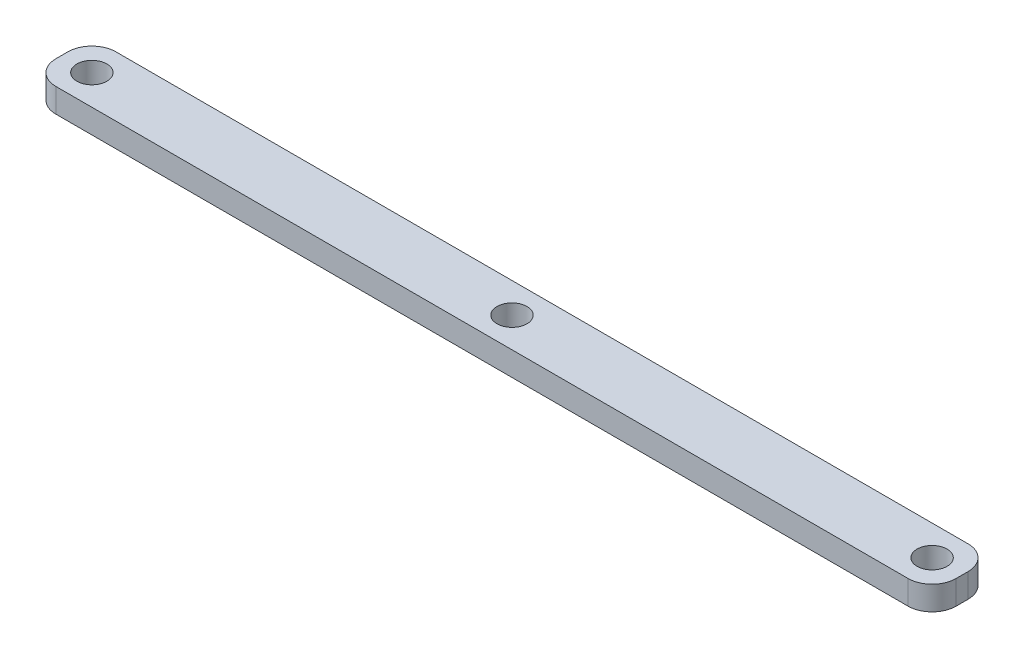
ISO-10303-21;
HEADER;
FILE_DESCRIPTION(('STEP AP214'),'2;1');
FILE_NAME('part.step','',(''),(''),'','','');
FILE_SCHEMA(('AUTOMOTIVE_DESIGN { 1 0 10303 214 1 1 1 1 }'));
ENDSEC;
DATA;
#1=APPLICATION_CONTEXT('core data for automotive mechanical design processes');
#2=APPLICATION_PROTOCOL_DEFINITION('international standard','automotive_design',2000,#1);
#3=PRODUCT_CONTEXT('',#1,'mechanical');
#4=PRODUCT('Part','Part','',(#3));
#5=PRODUCT_RELATED_PRODUCT_CATEGORY('part','',(#4));
#6=PRODUCT_DEFINITION_FORMATION('','',#4);
#7=PRODUCT_DEFINITION_CONTEXT('part definition',#1,'design');
#8=PRODUCT_DEFINITION('design','',#6,#7);
#9=PRODUCT_DEFINITION_SHAPE('','',#8);
#10=(LENGTH_UNIT() NAMED_UNIT(*) SI_UNIT(.MILLI.,.METRE.));
#11=(NAMED_UNIT(*) PLANE_ANGLE_UNIT() SI_UNIT($,.RADIAN.));
#12=(NAMED_UNIT(*) SI_UNIT($,.STERADIAN.) SOLID_ANGLE_UNIT());
#13=UNCERTAINTY_MEASURE_WITH_UNIT(LENGTH_MEASURE(1.E-05),#10,'distance_accuracy_value','');
#14=(GEOMETRIC_REPRESENTATION_CONTEXT(3) GLOBAL_UNCERTAINTY_ASSIGNED_CONTEXT((#13)) GLOBAL_UNIT_ASSIGNED_CONTEXT((#10,
#11,#12)) REPRESENTATION_CONTEXT('',''));
#15=CARTESIAN_POINT('',(0.,0.,0.));
#16=DIRECTION('',(0.,0.,1.));
#17=DIRECTION('',(1.,0.,0.));
#18=AXIS2_PLACEMENT_3D('',#15,#16,#17);
#19=CARTESIAN_POINT('',(0.,4.,0.));
#20=DIRECTION('',(0.,-1.,0.));
#21=DIRECTION('',(0.,0.,-1.));
#22=AXIS2_PLACEMENT_3D('',#19,#20,#21);
#23=PLANE('',#22);
#24=DIRECTION('',(1.,0.,0.));
#25=VECTOR('',#24,1.);
#26=CARTESIAN_POINT('',(-75.,4.,5.00000000000002));
#27=LINE('',#26,#25);
#28=CARTESIAN_POINT('',(-71.,4.,5.00000000000002));
#29=VERTEX_POINT('',#28);
#30=CARTESIAN_POINT('',(71.,4.,5.));
#31=VERTEX_POINT('',#30);
#32=EDGE_CURVE('E137',#29,#31,#27,.T.);
#33=ORIENTED_EDGE('',*,*,#32,.T.);
#34=CARTESIAN_POINT('',(71.,4.,0.999999999999998));
#35=DIRECTION('',(0.,-1.,0.));
#36=DIRECTION('',(0.,0.,-1.));
#37=AXIS2_PLACEMENT_3D('',#34,#35,#36);
#38=CIRCLE('',#37,4.);
#39=CARTESIAN_POINT('',(75.,4.,0.999999999999998));
#40=VERTEX_POINT('',#39);
#41=EDGE_CURVE('E156',#31,#40,#38,.F.);
#42=ORIENTED_EDGE('',*,*,#41,.T.);
#43=DIRECTION('',(0.,0.,-1.));
#44=VECTOR('',#43,1.);
#45=CARTESIAN_POINT('',(75.,4.,5.));
#46=LINE('',#45,#44);
#47=CARTESIAN_POINT('',(75.,4.,-1.00000000000001));
#48=VERTEX_POINT('',#47);
#49=EDGE_CURVE('E120',#40,#48,#46,.T.);
#50=ORIENTED_EDGE('',*,*,#49,.T.);
#51=CARTESIAN_POINT('',(71.,4.,-1.00000000000001));
#52=DIRECTION('',(0.,-1.,0.));
#53=DIRECTION('',(0.,0.,-1.));
#54=AXIS2_PLACEMENT_3D('',#51,#52,#53);
#55=CIRCLE('',#54,4.);
#56=CARTESIAN_POINT('',(71.,4.,-5.00000000000002));
#57=VERTEX_POINT('',#56);
#58=EDGE_CURVE('E154',#48,#57,#55,.F.);
#59=ORIENTED_EDGE('',*,*,#58,.T.);
#60=DIRECTION('',(-1.,0.,0.));
#61=VECTOR('',#60,1.);
#62=CARTESIAN_POINT('',(-75.,4.,-4.99999999999998));
#63=LINE('',#62,#61);
#64=CARTESIAN_POINT('',(-71.,4.,-4.99999999999999));
#65=VERTEX_POINT('',#64);
#66=EDGE_CURVE('E167',#57,#65,#63,.T.);
#67=ORIENTED_EDGE('',*,*,#66,.T.);
#68=CARTESIAN_POINT('',(-71.,4.,-0.999999999999985));
#69=DIRECTION('',(0.,-1.,0.));
#70=DIRECTION('',(0.,0.,-1.));
#71=AXIS2_PLACEMENT_3D('',#68,#69,#70);
#72=CIRCLE('',#71,4.);
#73=CARTESIAN_POINT('',(-75.,4.,-0.999999999999985));
#74=VERTEX_POINT('',#73);
#75=EDGE_CURVE('E55',#65,#74,#72,.F.);
#76=ORIENTED_EDGE('',*,*,#75,.T.);
#77=DIRECTION('',(0.,0.,1.));
#78=VECTOR('',#77,1.);
#79=CARTESIAN_POINT('',(-75.,4.,5.00000000000002));
#80=LINE('',#79,#78);
#81=CARTESIAN_POINT('',(-75.,4.,1.00000000000002));
#82=VERTEX_POINT('',#81);
#83=EDGE_CURVE('E175',#74,#82,#80,.T.);
#84=ORIENTED_EDGE('',*,*,#83,.T.);
#85=CARTESIAN_POINT('',(-71.,4.,1.00000000000002));
#86=DIRECTION('',(0.,-1.,0.));
#87=DIRECTION('',(0.,0.,-1.));
#88=AXIS2_PLACEMENT_3D('',#85,#86,#87);
#89=CIRCLE('',#88,4.);
#90=EDGE_CURVE('E151',#82,#29,#89,.F.);
#91=ORIENTED_EDGE('',*,*,#90,.T.);
#92=EDGE_LOOP('',(#33,#42,#50,#59,#67,#76,#84,#91));
#93=FACE_BOUND('',#92,.T.);
#94=CARTESIAN_POINT('',(-70.,4.,0.));
#95=DIRECTION('',(0.,1.,0.));
#96=DIRECTION('',(0.,0.,1.));
#97=AXIS2_PLACEMENT_3D('',#94,#95,#96);
#98=CIRCLE('',#97,2.50000000000001);
#99=CARTESIAN_POINT('',(-70.,4.,2.50000000000002));
#100=VERTEX_POINT('',#99);
#101=EDGE_CURVE('E128',#100,#100,#98,.T.);
#102=ORIENTED_EDGE('',*,*,#101,.F.);
#103=EDGE_LOOP('',(#102));
#104=FACE_BOUND('',#103,.T.);
#105=CARTESIAN_POINT('',(70.,4.,0.));
#106=DIRECTION('',(0.,1.,0.));
#107=DIRECTION('',(0.,0.,-1.));
#108=AXIS2_PLACEMENT_3D('',#105,#106,#107);
#109=CIRCLE('',#108,2.50000000000001);
#110=CARTESIAN_POINT('',(70.,4.,-2.50000000000001));
#111=VERTEX_POINT('',#110);
#112=EDGE_CURVE('E182',#111,#111,#109,.T.);
#113=ORIENTED_EDGE('',*,*,#112,.F.);
#114=EDGE_LOOP('',(#113));
#115=FACE_BOUND('',#114,.T.);
#116=CARTESIAN_POINT('',(0.,4.,0.));
#117=DIRECTION('',(0.,1.,0.));
#118=DIRECTION('',(0.,0.,1.));
#119=AXIS2_PLACEMENT_3D('',#116,#117,#118);
#120=CIRCLE('',#119,2.5);
#121=CARTESIAN_POINT('',(0.,4.,2.5));
#122=VERTEX_POINT('',#121);
#123=EDGE_CURVE('E187',#122,#122,#120,.T.);
#124=ORIENTED_EDGE('',*,*,#123,.F.);
#125=EDGE_LOOP('',(#124));
#126=FACE_BOUND('',#125,.T.);
#127=ADVANCED_FACE('F34',(#93,#104,#115,#126),#23,.F.);
#128=CARTESIAN_POINT('',(0.,0.,0.));
#129=DIRECTION('',(0.,-1.,0.));
#130=DIRECTION('',(0.,0.,-1.));
#131=AXIS2_PLACEMENT_3D('',#128,#129,#130);
#132=PLANE('',#131);
#133=CARTESIAN_POINT('',(70.,0.,0.));
#134=DIRECTION('',(0.,1.,0.));
#135=DIRECTION('',(0.,0.,-1.));
#136=AXIS2_PLACEMENT_3D('',#133,#134,#135);
#137=CIRCLE('',#136,2.50000000000001);
#138=CARTESIAN_POINT('',(70.,0.,-2.50000000000001));
#139=VERTEX_POINT('',#138);
#140=EDGE_CURVE('E184',#139,#139,#137,.T.);
#141=ORIENTED_EDGE('',*,*,#140,.T.);
#142=EDGE_LOOP('',(#141));
#143=FACE_BOUND('',#142,.T.);
#144=DIRECTION('',(0.,0.,-1.));
#145=VECTOR('',#144,1.);
#146=CARTESIAN_POINT('',(75.,0.,5.));
#147=LINE('',#146,#145);
#148=CARTESIAN_POINT('',(75.,0.,0.999999999999998));
#149=VERTEX_POINT('',#148);
#150=CARTESIAN_POINT('',(75.,0.,-1.00000000000001));
#151=VERTEX_POINT('',#150);
#152=EDGE_CURVE('E117',#149,#151,#147,.T.);
#153=ORIENTED_EDGE('',*,*,#152,.F.);
#154=CARTESIAN_POINT('',(71.,0.,0.999999999999998));
#155=DIRECTION('',(0.,-1.,0.));
#156=DIRECTION('',(0.,0.,-1.));
#157=AXIS2_PLACEMENT_3D('',#154,#155,#156);
#158=CIRCLE('',#157,4.);
#159=CARTESIAN_POINT('',(71.,0.,5.));
#160=VERTEX_POINT('',#159);
#161=EDGE_CURVE('E100',#149,#160,#158,.T.);
#162=ORIENTED_EDGE('',*,*,#161,.T.);
#163=DIRECTION('',(1.,0.,0.));
#164=VECTOR('',#163,1.);
#165=CARTESIAN_POINT('',(-75.,0.,5.00000000000002));
#166=LINE('',#165,#164);
#167=CARTESIAN_POINT('',(-71.,0.,5.00000000000002));
#168=VERTEX_POINT('',#167);
#169=EDGE_CURVE('E141',#168,#160,#166,.T.);
#170=ORIENTED_EDGE('',*,*,#169,.F.);
#171=CARTESIAN_POINT('',(-71.,0.,1.00000000000002));
#172=DIRECTION('',(0.,-1.,0.));
#173=DIRECTION('',(0.,0.,-1.));
#174=AXIS2_PLACEMENT_3D('',#171,#172,#173);
#175=CIRCLE('',#174,4.);
#176=CARTESIAN_POINT('',(-75.,0.,1.00000000000002));
#177=VERTEX_POINT('',#176);
#178=EDGE_CURVE('E121',#168,#177,#175,.T.);
#179=ORIENTED_EDGE('',*,*,#178,.T.);
#180=DIRECTION('',(0.,0.,1.));
#181=VECTOR('',#180,1.);
#182=CARTESIAN_POINT('',(-75.,0.,5.00000000000002));
#183=LINE('',#182,#181);
#184=CARTESIAN_POINT('',(-75.,0.,-0.999999999999985));
#185=VERTEX_POINT('',#184);
#186=EDGE_CURVE('E131',#185,#177,#183,.T.);
#187=ORIENTED_EDGE('',*,*,#186,.F.);
#188=CARTESIAN_POINT('',(-71.,0.,-0.999999999999985));
#189=DIRECTION('',(0.,-1.,0.));
#190=DIRECTION('',(0.,0.,-1.));
#191=AXIS2_PLACEMENT_3D('',#188,#189,#190);
#192=CIRCLE('',#191,4.);
#193=CARTESIAN_POINT('',(-71.,0.,-4.99999999999999));
#194=VERTEX_POINT('',#193);
#195=EDGE_CURVE('E145',#185,#194,#192,.T.);
#196=ORIENTED_EDGE('',*,*,#195,.T.);
#197=DIRECTION('',(-1.,0.,0.));
#198=VECTOR('',#197,1.);
#199=CARTESIAN_POINT('',(-75.,0.,-4.99999999999998));
#200=LINE('',#199,#198);
#201=CARTESIAN_POINT('',(71.,0.,-5.00000000000002));
#202=VERTEX_POINT('',#201);
#203=EDGE_CURVE('E127',#202,#194,#200,.T.);
#204=ORIENTED_EDGE('',*,*,#203,.F.);
#205=CARTESIAN_POINT('',(71.,0.,-1.00000000000001));
#206=DIRECTION('',(0.,-1.,0.));
#207=DIRECTION('',(0.,0.,-1.));
#208=AXIS2_PLACEMENT_3D('',#205,#206,#207);
#209=CIRCLE('',#208,4.);
#210=EDGE_CURVE('E111',#202,#151,#209,.T.);
#211=ORIENTED_EDGE('',*,*,#210,.T.);
#212=EDGE_LOOP('',(#153,#162,#170,#179,#187,#196,#204,#211));
#213=FACE_BOUND('',#212,.T.);
#214=CARTESIAN_POINT('',(-70.,0.,0.));
#215=DIRECTION('',(0.,1.,0.));
#216=DIRECTION('',(0.,0.,1.));
#217=AXIS2_PLACEMENT_3D('',#214,#215,#216);
#218=CIRCLE('',#217,2.50000000000001);
#219=CARTESIAN_POINT('',(-70.,0.,2.50000000000002));
#220=VERTEX_POINT('',#219);
#221=EDGE_CURVE('E134',#220,#220,#218,.T.);
#222=ORIENTED_EDGE('',*,*,#221,.T.);
#223=EDGE_LOOP('',(#222));
#224=FACE_BOUND('',#223,.T.);
#225=CARTESIAN_POINT('',(0.,0.,0.));
#226=DIRECTION('',(0.,1.,0.));
#227=DIRECTION('',(0.,0.,1.));
#228=AXIS2_PLACEMENT_3D('',#225,#226,#227);
#229=CIRCLE('',#228,2.5);
#230=CARTESIAN_POINT('',(0.,0.,2.5));
#231=VERTEX_POINT('',#230);
#232=EDGE_CURVE('E190',#231,#231,#229,.T.);
#233=ORIENTED_EDGE('',*,*,#232,.T.);
#234=EDGE_LOOP('',(#233));
#235=FACE_BOUND('',#234,.T.);
#236=ADVANCED_FACE('F124',(#143,#213,#224,#235),#132,.T.);
#237=CARTESIAN_POINT('',(75.,4.,5.));
#238=DIRECTION('',(-1.,0.,0.));
#239=DIRECTION('',(0.,0.,1.));
#240=AXIS2_PLACEMENT_3D('',#237,#238,#239);
#241=PLANE('',#240);
#242=ORIENTED_EDGE('',*,*,#49,.F.);
#243=DIRECTION('',(0.,-1.,0.));
#244=VECTOR('',#243,1.);
#245=CARTESIAN_POINT('',(75.,4.,0.999999999999998));
#246=LINE('',#245,#244);
#247=EDGE_CURVE('E104',#40,#149,#246,.T.);
#248=ORIENTED_EDGE('',*,*,#247,.T.);
#249=ORIENTED_EDGE('',*,*,#152,.T.);
#250=DIRECTION('',(0.,-1.,0.));
#251=VECTOR('',#250,1.);
#252=CARTESIAN_POINT('',(75.,4.,-1.00000000000001));
#253=LINE('',#252,#251);
#254=EDGE_CURVE('E122',#151,#48,#253,.F.);
#255=ORIENTED_EDGE('',*,*,#254,.T.);
#256=EDGE_LOOP('',(#242,#248,#249,#255));
#257=FACE_BOUND('',#256,.T.);
#258=ADVANCED_FACE('F116',(#257),#241,.F.);
#259=CARTESIAN_POINT('',(-75.,4.,-4.99999999999998));
#260=DIRECTION('',(0.,0.,1.));
#261=DIRECTION('',(1.,0.,0.));
#262=AXIS2_PLACEMENT_3D('',#259,#260,#261);
#263=PLANE('',#262);
#264=ORIENTED_EDGE('',*,*,#66,.F.);
#265=DIRECTION('',(0.,-1.,0.));
#266=VECTOR('',#265,1.);
#267=CARTESIAN_POINT('',(71.,4.,-5.00000000000002));
#268=LINE('',#267,#266);
#269=EDGE_CURVE('E160',#57,#202,#268,.T.);
#270=ORIENTED_EDGE('',*,*,#269,.T.);
#271=ORIENTED_EDGE('',*,*,#203,.T.);
#272=DIRECTION('',(0.,-1.,0.));
#273=VECTOR('',#272,1.);
#274=CARTESIAN_POINT('',(-71.,4.,-4.99999999999999));
#275=LINE('',#274,#273);
#276=EDGE_CURVE('E158',#194,#65,#275,.F.);
#277=ORIENTED_EDGE('',*,*,#276,.T.);
#278=EDGE_LOOP('',(#264,#270,#271,#277));
#279=FACE_BOUND('',#278,.T.);
#280=ADVANCED_FACE('F165',(#279),#263,.F.);
#281=CARTESIAN_POINT('',(-75.,4.,5.00000000000002));
#282=DIRECTION('',(1.,0.,0.));
#283=DIRECTION('',(0.,0.,-1.));
#284=AXIS2_PLACEMENT_3D('',#281,#282,#283);
#285=PLANE('',#284);
#286=ORIENTED_EDGE('',*,*,#83,.F.);
#287=DIRECTION('',(0.,-1.,0.));
#288=VECTOR('',#287,1.);
#289=CARTESIAN_POINT('',(-75.,4.,-0.999999999999985));
#290=LINE('',#289,#288);
#291=EDGE_CURVE('E11',#74,#185,#290,.T.);
#292=ORIENTED_EDGE('',*,*,#291,.T.);
#293=ORIENTED_EDGE('',*,*,#186,.T.);
#294=DIRECTION('',(0.,-1.,0.));
#295=VECTOR('',#294,1.);
#296=CARTESIAN_POINT('',(-75.,4.,1.00000000000002));
#297=LINE('',#296,#295);
#298=EDGE_CURVE('E42',#177,#82,#297,.F.);
#299=ORIENTED_EDGE('',*,*,#298,.T.);
#300=EDGE_LOOP('',(#286,#292,#293,#299));
#301=FACE_BOUND('',#300,.T.);
#302=ADVANCED_FACE('F174',(#301),#285,.F.);
#303=CARTESIAN_POINT('',(-75.,4.,5.00000000000002));
#304=DIRECTION('',(0.,0.,-1.));
#305=DIRECTION('',(-1.,0.,0.));
#306=AXIS2_PLACEMENT_3D('',#303,#304,#305);
#307=PLANE('',#306);
#308=ORIENTED_EDGE('',*,*,#169,.T.);
#309=DIRECTION('',(0.,-1.,0.));
#310=VECTOR('',#309,1.);
#311=CARTESIAN_POINT('',(71.,4.,5.));
#312=LINE('',#311,#310);
#313=EDGE_CURVE('E105',#160,#31,#312,.F.);
#314=ORIENTED_EDGE('',*,*,#313,.T.);
#315=ORIENTED_EDGE('',*,*,#32,.F.);
#316=DIRECTION('',(0.,-1.,0.));
#317=VECTOR('',#316,1.);
#318=CARTESIAN_POINT('',(-71.,4.,5.00000000000002));
#319=LINE('',#318,#317);
#320=EDGE_CURVE('E110',#29,#168,#319,.T.);
#321=ORIENTED_EDGE('',*,*,#320,.T.);
#322=EDGE_LOOP('',(#308,#314,#315,#321));
#323=FACE_BOUND('',#322,.T.);
#324=ADVANCED_FACE('F211',(#323),#307,.F.);
#325=CARTESIAN_POINT('',(-70.,4.,0.));
#326=DIRECTION('',(0.,-1.,0.));
#327=DIRECTION('',(0.,0.,-1.));
#328=AXIS2_PLACEMENT_3D('',#325,#326,#327);
#329=CYLINDRICAL_SURFACE('',#328,2.50000000000001);
#330=ORIENTED_EDGE('',*,*,#101,.T.);
#331=EDGE_LOOP('',(#330));
#332=FACE_BOUND('',#331,.T.);
#333=ORIENTED_EDGE('',*,*,#221,.F.);
#334=EDGE_LOOP('',(#333));
#335=FACE_BOUND('',#334,.T.);
#336=ADVANCED_FACE('F208',(#332,#335),#329,.F.);
#337=CARTESIAN_POINT('',(70.,4.,0.));
#338=DIRECTION('',(0.,-1.,0.));
#339=DIRECTION('',(0.,0.,-1.));
#340=AXIS2_PLACEMENT_3D('',#337,#338,#339);
#341=CYLINDRICAL_SURFACE('',#340,2.50000000000001);
#342=ORIENTED_EDGE('',*,*,#112,.T.);
#343=EDGE_LOOP('',(#342));
#344=FACE_BOUND('',#343,.T.);
#345=ORIENTED_EDGE('',*,*,#140,.F.);
#346=EDGE_LOOP('',(#345));
#347=FACE_BOUND('',#346,.T.);
#348=ADVANCED_FACE('F295',(#344,#347),#341,.F.);
#349=CARTESIAN_POINT('',(0.,4.,0.));
#350=DIRECTION('',(0.,-1.,0.));
#351=DIRECTION('',(0.,0.,-1.));
#352=AXIS2_PLACEMENT_3D('',#349,#350,#351);
#353=CYLINDRICAL_SURFACE('',#352,2.5);
#354=ORIENTED_EDGE('',*,*,#123,.T.);
#355=EDGE_LOOP('',(#354));
#356=FACE_BOUND('',#355,.T.);
#357=ORIENTED_EDGE('',*,*,#232,.F.);
#358=EDGE_LOOP('',(#357));
#359=FACE_BOUND('',#358,.T.);
#360=ADVANCED_FACE('F196',(#356,#359),#353,.F.);
#361=CARTESIAN_POINT('',(71.,4.,0.999999999999998));
#362=DIRECTION('',(0.,-1.,0.));
#363=DIRECTION('',(0.,0.,-1.));
#364=AXIS2_PLACEMENT_3D('',#361,#362,#363);
#365=CYLINDRICAL_SURFACE('',#364,4.);
#366=ORIENTED_EDGE('',*,*,#41,.F.);
#367=ORIENTED_EDGE('',*,*,#313,.F.);
#368=ORIENTED_EDGE('',*,*,#161,.F.);
#369=ORIENTED_EDGE('',*,*,#247,.F.);
#370=EDGE_LOOP('',(#366,#367,#368,#369));
#371=FACE_BOUND('',#370,.T.);
#372=ADVANCED_FACE('F103',(#371),#365,.T.);
#373=CARTESIAN_POINT('',(71.,4.,-1.00000000000001));
#374=DIRECTION('',(0.,-1.,0.));
#375=DIRECTION('',(0.,0.,-1.));
#376=AXIS2_PLACEMENT_3D('',#373,#374,#375);
#377=CYLINDRICAL_SURFACE('',#376,4.);
#378=ORIENTED_EDGE('',*,*,#58,.F.);
#379=ORIENTED_EDGE('',*,*,#254,.F.);
#380=ORIENTED_EDGE('',*,*,#210,.F.);
#381=ORIENTED_EDGE('',*,*,#269,.F.);
#382=EDGE_LOOP('',(#378,#379,#380,#381));
#383=FACE_BOUND('',#382,.T.);
#384=ADVANCED_FACE('F223',(#383),#377,.T.);
#385=CARTESIAN_POINT('',(-71.,4.,-0.999999999999985));
#386=DIRECTION('',(0.,-1.,0.));
#387=DIRECTION('',(0.,0.,-1.));
#388=AXIS2_PLACEMENT_3D('',#385,#386,#387);
#389=CYLINDRICAL_SURFACE('',#388,4.);
#390=ORIENTED_EDGE('',*,*,#75,.F.);
#391=ORIENTED_EDGE('',*,*,#276,.F.);
#392=ORIENTED_EDGE('',*,*,#195,.F.);
#393=ORIENTED_EDGE('',*,*,#291,.F.);
#394=EDGE_LOOP('',(#390,#391,#392,#393));
#395=FACE_BOUND('',#394,.T.);
#396=ADVANCED_FACE('F173',(#395),#389,.T.);
#397=CARTESIAN_POINT('',(-71.,4.,1.00000000000002));
#398=DIRECTION('',(0.,-1.,0.));
#399=DIRECTION('',(0.,0.,-1.));
#400=AXIS2_PLACEMENT_3D('',#397,#398,#399);
#401=CYLINDRICAL_SURFACE('',#400,4.);
#402=ORIENTED_EDGE('',*,*,#90,.F.);
#403=ORIENTED_EDGE('',*,*,#298,.F.);
#404=ORIENTED_EDGE('',*,*,#178,.F.);
#405=ORIENTED_EDGE('',*,*,#320,.F.);
#406=EDGE_LOOP('',(#402,#403,#404,#405));
#407=FACE_BOUND('',#406,.T.);
#408=ADVANCED_FACE('F36',(#407),#401,.T.);
#409=CLOSED_SHELL('',(#127,#236,#258,#280,#302,#324,#336,#348,#360,#372,#384,#396,#408));
#410=MANIFOLD_SOLID_BREP('B2',#409);
#411=ADVANCED_BREP_SHAPE_REPRESENTATION('',(#18,#410),#14);
#412=SHAPE_DEFINITION_REPRESENTATION(#9,#411);
ENDSEC;
END-ISO-10303-21;
